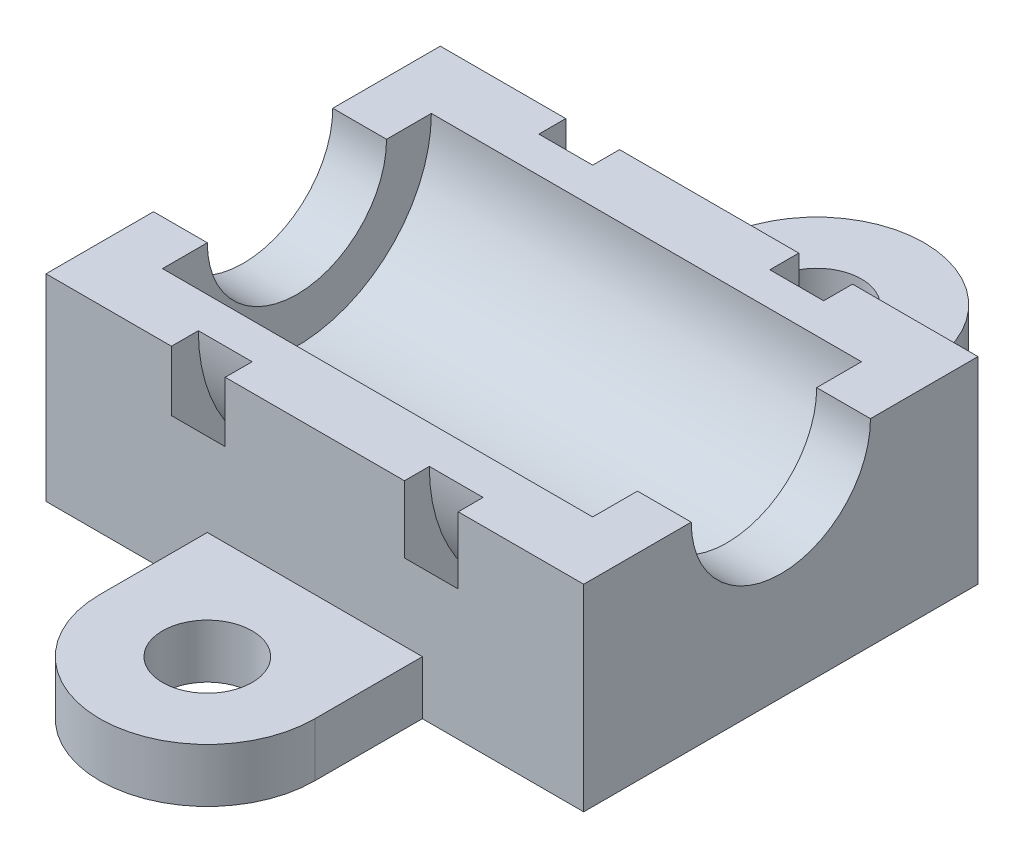
ISO-10303-21;
HEADER;
FILE_DESCRIPTION(('STEP AP214'),'2;1');
FILE_NAME('part.step','',(''),(''),'','','');
FILE_SCHEMA(('AUTOMOTIVE_DESIGN { 1 0 10303 214 1 1 1 1 }'));
ENDSEC;
DATA;
#1=APPLICATION_CONTEXT('core data for automotive mechanical design processes');
#2=APPLICATION_PROTOCOL_DEFINITION('international standard','automotive_design',2000,#1);
#3=PRODUCT_CONTEXT('',#1,'mechanical');
#4=PRODUCT('Part','Part','',(#3));
#5=PRODUCT_RELATED_PRODUCT_CATEGORY('part','',(#4));
#6=PRODUCT_DEFINITION_FORMATION('','',#4);
#7=PRODUCT_DEFINITION_CONTEXT('part definition',#1,'design');
#8=PRODUCT_DEFINITION('design','',#6,#7);
#9=PRODUCT_DEFINITION_SHAPE('','',#8);
#10=(LENGTH_UNIT() NAMED_UNIT(*) SI_UNIT(.MILLI.,.METRE.));
#11=(NAMED_UNIT(*) PLANE_ANGLE_UNIT() SI_UNIT($,.RADIAN.));
#12=(NAMED_UNIT(*) SI_UNIT($,.STERADIAN.) SOLID_ANGLE_UNIT());
#13=UNCERTAINTY_MEASURE_WITH_UNIT(LENGTH_MEASURE(1.E-05),#10,'distance_accuracy_value','');
#14=(GEOMETRIC_REPRESENTATION_CONTEXT(3) GLOBAL_UNCERTAINTY_ASSIGNED_CONTEXT((#13)) GLOBAL_UNIT_ASSIGNED_CONTEXT((#10,
#11,#12)) REPRESENTATION_CONTEXT('',''));
#15=CARTESIAN_POINT('',(0.,0.,0.));
#16=DIRECTION('',(0.,0.,1.));
#17=DIRECTION('',(1.,0.,0.));
#18=AXIS2_PLACEMENT_3D('',#15,#16,#17);
#19=CARTESIAN_POINT('',(30.,11.,-11.));
#20=DIRECTION('',(-1.,0.,0.));
#21=DIRECTION('',(0.,0.,1.));
#22=AXIS2_PLACEMENT_3D('',#19,#20,#21);
#23=CYLINDRICAL_SURFACE('',#22,5.);
#24=CARTESIAN_POINT('',(27.,11.,-11.));
#25=DIRECTION('',(-1.,0.,0.));
#26=DIRECTION('',(0.,0.,1.));
#27=AXIS2_PLACEMENT_3D('',#24,#25,#26);
#28=CIRCLE('',#27,5.);
#29=CARTESIAN_POINT('',(27.,11.,-6.));
#30=VERTEX_POINT('',#29);
#31=CARTESIAN_POINT('',(27.,11.,-16.));
#32=VERTEX_POINT('',#31);
#33=EDGE_CURVE('E508',#30,#32,#28,.F.);
#34=ORIENTED_EDGE('',*,*,#33,.F.);
#35=DIRECTION('',(-1.,0.,0.));
#36=VECTOR('',#35,1.);
#37=CARTESIAN_POINT('',(30.,11.,-6.));
#38=LINE('',#37,#36);
#39=CARTESIAN_POINT('',(30.,11.,-6.));
#40=VERTEX_POINT('',#39);
#41=EDGE_CURVE('E271',#30,#40,#38,.F.);
#42=ORIENTED_EDGE('',*,*,#41,.T.);
#43=CARTESIAN_POINT('',(30.,11.,-11.));
#44=DIRECTION('',(-1.,0.,0.));
#45=DIRECTION('',(0.,0.,1.));
#46=AXIS2_PLACEMENT_3D('',#43,#44,#45);
#47=CIRCLE('',#46,5.);
#48=CARTESIAN_POINT('',(30.,11.,-16.));
#49=VERTEX_POINT('',#48);
#50=EDGE_CURVE('E362',#49,#40,#47,.T.);
#51=ORIENTED_EDGE('',*,*,#50,.F.);
#52=DIRECTION('',(-1.,0.,0.));
#53=VECTOR('',#52,1.);
#54=CARTESIAN_POINT('',(30.,11.,-16.));
#55=LINE('',#54,#53);
#56=EDGE_CURVE('E484',#49,#32,#55,.T.);
#57=ORIENTED_EDGE('',*,*,#56,.T.);
#58=EDGE_LOOP('',(#34,#42,#51,#57));
#59=FACE_BOUND('',#58,.T.);
#60=ADVANCED_FACE('F35',(#59),#23,.F.);
#61=CARTESIAN_POINT('',(0.,0.,0.));
#62=DIRECTION('',(0.,1.,0.));
#63=DIRECTION('',(0.,0.,1.));
#64=AXIS2_PLACEMENT_3D('',#61,#62,#63);
#65=PLANE('',#64);
#66=DIRECTION('',(1.,0.,0.));
#67=VECTOR('',#66,1.);
#68=CARTESIAN_POINT('',(7.,0.,-7.64589803375031));
#69=LINE('',#68,#67);
#70=CARTESIAN_POINT('',(10.,0.,-7.64589803375031));
#71=VERTEX_POINT('',#70);
#72=CARTESIAN_POINT('',(7.,0.,-7.64589803375031));
#73=VERTEX_POINT('',#72);
#74=EDGE_CURVE('E494',#71,#73,#69,.F.);
#75=ORIENTED_EDGE('',*,*,#74,.F.);
#76=DIRECTION('',(0.,0.,1.));
#77=VECTOR('',#76,1.);
#78=CARTESIAN_POINT('',(10.,0.,0.));
#79=LINE('',#78,#77);
#80=CARTESIAN_POINT('',(10.,0.,-14.3541019662497));
#81=VERTEX_POINT('',#80);
#82=EDGE_CURVE('E489',#81,#71,#79,.T.);
#83=ORIENTED_EDGE('',*,*,#82,.F.);
#84=DIRECTION('',(1.,0.,0.));
#85=VECTOR('',#84,1.);
#86=CARTESIAN_POINT('',(7.,0.,-14.3541019662497));
#87=LINE('',#86,#85);
#88=CARTESIAN_POINT('',(7.,0.,-14.3541019662497));
#89=VERTEX_POINT('',#88);
#90=EDGE_CURVE('E487',#89,#81,#87,.T.);
#91=ORIENTED_EDGE('',*,*,#90,.F.);
#92=DIRECTION('',(0.,0.,1.));
#93=VECTOR('',#92,1.);
#94=CARTESIAN_POINT('',(7.,0.,0.));
#95=LINE('',#94,#93);
#96=EDGE_CURVE('E491',#89,#73,#95,.T.);
#97=ORIENTED_EDGE('',*,*,#96,.T.);
#98=EDGE_LOOP('',(#75,#83,#91,#97));
#99=FACE_BOUND('',#98,.T.);
#100=DIRECTION('',(0.,0.,1.));
#101=VECTOR('',#100,1.);
#102=CARTESIAN_POINT('',(0.,0.,-22.));
#103=LINE('',#102,#101);
#104=CARTESIAN_POINT('',(0.,0.,-22.));
#105=VERTEX_POINT('',#104);
#106=CARTESIAN_POINT('',(0.,0.,0.));
#107=VERTEX_POINT('',#106);
#108=EDGE_CURVE('E432',#105,#107,#103,.T.);
#109=ORIENTED_EDGE('',*,*,#108,.F.);
#110=DIRECTION('',(-1.,0.,0.));
#111=VECTOR('',#110,1.);
#112=CARTESIAN_POINT('',(30.,0.,-22.));
#113=LINE('',#112,#111);
#114=CARTESIAN_POINT('',(9.,0.,-22.));
#115=VERTEX_POINT('',#114);
#116=EDGE_CURVE('E465',#115,#105,#113,.T.);
#117=ORIENTED_EDGE('',*,*,#116,.F.);
#118=DIRECTION('',(0.,0.,-1.));
#119=VECTOR('',#118,1.);
#120=CARTESIAN_POINT('',(9.,0.,-22.));
#121=LINE('',#120,#119);
#122=CARTESIAN_POINT('',(9.,0.,-28.));
#123=VERTEX_POINT('',#122);
#124=EDGE_CURVE('E377',#115,#123,#121,.T.);
#125=ORIENTED_EDGE('',*,*,#124,.T.);
#126=CARTESIAN_POINT('',(15.,0.,-28.));
#127=DIRECTION('',(0.,-1.,0.));
#128=DIRECTION('',(0.,0.,1.));
#129=AXIS2_PLACEMENT_3D('',#126,#127,#128);
#130=CIRCLE('',#129,6.);
#131=CARTESIAN_POINT('',(21.,0.,-28.));
#132=VERTEX_POINT('',#131);
#133=EDGE_CURVE('E370',#123,#132,#130,.T.);
#134=ORIENTED_EDGE('',*,*,#133,.T.);
#135=DIRECTION('',(0.,0.,1.));
#136=VECTOR('',#135,1.);
#137=CARTESIAN_POINT('',(21.,0.,-28.));
#138=LINE('',#137,#136);
#139=CARTESIAN_POINT('',(21.,0.,-22.));
#140=VERTEX_POINT('',#139);
#141=EDGE_CURVE('E389',#132,#140,#138,.T.);
#142=ORIENTED_EDGE('',*,*,#141,.T.);
#143=CARTESIAN_POINT('',(30.,0.,-22.));
#144=VERTEX_POINT('',#143);
#145=EDGE_CURVE('E466',#144,#140,#113,.T.);
#146=ORIENTED_EDGE('',*,*,#145,.F.);
#147=DIRECTION('',(0.,0.,-1.));
#148=VECTOR('',#147,1.);
#149=CARTESIAN_POINT('',(30.,0.,0.));
#150=LINE('',#149,#148);
#151=CARTESIAN_POINT('',(30.,0.,0.));
#152=VERTEX_POINT('',#151);
#153=EDGE_CURVE('E463',#152,#144,#150,.T.);
#154=ORIENTED_EDGE('',*,*,#153,.F.);
#155=DIRECTION('',(1.,0.,0.));
#156=VECTOR('',#155,1.);
#157=CARTESIAN_POINT('',(0.,0.,0.));
#158=LINE('',#157,#156);
#159=CARTESIAN_POINT('',(21.,0.,0.));
#160=VERTEX_POINT('',#159);
#161=EDGE_CURVE('E459',#160,#152,#158,.T.);
#162=ORIENTED_EDGE('',*,*,#161,.F.);
#163=DIRECTION('',(0.,0.,1.));
#164=VECTOR('',#163,1.);
#165=CARTESIAN_POINT('',(21.,0.,6.));
#166=LINE('',#165,#164);
#167=CARTESIAN_POINT('',(21.,0.,6.));
#168=VERTEX_POINT('',#167);
#169=EDGE_CURVE('E413',#160,#168,#166,.T.);
#170=ORIENTED_EDGE('',*,*,#169,.T.);
#171=CARTESIAN_POINT('',(15.,0.,6.));
#172=DIRECTION('',(0.,-1.,0.));
#173=DIRECTION('',(0.,0.,-1.));
#174=AXIS2_PLACEMENT_3D('',#171,#172,#173);
#175=CIRCLE('',#174,6.);
#176=CARTESIAN_POINT('',(9.,0.,6.));
#177=VERTEX_POINT('',#176);
#178=EDGE_CURVE('E406',#168,#177,#175,.T.);
#179=ORIENTED_EDGE('',*,*,#178,.T.);
#180=DIRECTION('',(0.,0.,-1.));
#181=VECTOR('',#180,1.);
#182=CARTESIAN_POINT('',(9.,0.,0.));
#183=LINE('',#182,#181);
#184=CARTESIAN_POINT('',(9.,0.,0.));
#185=VERTEX_POINT('',#184);
#186=EDGE_CURVE('E425',#177,#185,#183,.T.);
#187=ORIENTED_EDGE('',*,*,#186,.T.);
#188=EDGE_CURVE('E460',#107,#185,#158,.T.);
#189=ORIENTED_EDGE('',*,*,#188,.F.);
#190=EDGE_LOOP('',(#109,#117,#125,#134,#142,#146,#154,#162,#170,#179,#187,#189));
#191=FACE_BOUND('',#190,.T.);
#192=CARTESIAN_POINT('',(15.,0.,6.));
#193=DIRECTION('',(0.,-1.,0.));
#194=DIRECTION('',(0.,0.,-1.));
#195=AXIS2_PLACEMENT_3D('',#192,#193,#194);
#196=CIRCLE('',#195,2.5);
#197=CARTESIAN_POINT('',(15.,0.,3.5));
#198=VERTEX_POINT('',#197);
#199=EDGE_CURVE('E396',#198,#198,#196,.T.);
#200=ORIENTED_EDGE('',*,*,#199,.F.);
#201=EDGE_LOOP('',(#200));
#202=FACE_BOUND('',#201,.T.);
#203=CARTESIAN_POINT('',(15.,0.,-28.));
#204=DIRECTION('',(0.,-1.,0.));
#205=DIRECTION('',(0.,0.,1.));
#206=AXIS2_PLACEMENT_3D('',#203,#204,#205);
#207=CIRCLE('',#206,2.5);
#208=CARTESIAN_POINT('',(15.,0.,-25.5));
#209=VERTEX_POINT('',#208);
#210=EDGE_CURVE('E365',#209,#209,#207,.T.);
#211=ORIENTED_EDGE('',*,*,#210,.F.);
#212=EDGE_LOOP('',(#211));
#213=FACE_BOUND('',#212,.T.);
#214=DIRECTION('',(-1.,0.,0.));
#215=VECTOR('',#214,1.);
#216=CARTESIAN_POINT('',(23.,0.,-14.3294980378266));
#217=LINE('',#216,#215);
#218=CARTESIAN_POINT('',(20.,0.,-14.3294980378266));
#219=VERTEX_POINT('',#218);
#220=CARTESIAN_POINT('',(23.,0.,-14.3294980378266));
#221=VERTEX_POINT('',#220);
#222=EDGE_CURVE('E320',#219,#221,#217,.F.);
#223=ORIENTED_EDGE('',*,*,#222,.F.);
#224=DIRECTION('',(0.,0.,-1.));
#225=VECTOR('',#224,1.);
#226=CARTESIAN_POINT('',(20.,0.,0.));
#227=LINE('',#226,#225);
#228=CARTESIAN_POINT('',(20.,0.,-7.44487365788936));
#229=VERTEX_POINT('',#228);
#230=EDGE_CURVE('E303',#229,#219,#227,.T.);
#231=ORIENTED_EDGE('',*,*,#230,.F.);
#232=DIRECTION('',(-1.,0.,0.));
#233=VECTOR('',#232,1.);
#234=CARTESIAN_POINT('',(23.,0.,-7.44487365788936));
#235=LINE('',#234,#233);
#236=CARTESIAN_POINT('',(23.,0.,-7.44487365788936));
#237=VERTEX_POINT('',#236);
#238=EDGE_CURVE('E318',#237,#229,#235,.T.);
#239=ORIENTED_EDGE('',*,*,#238,.F.);
#240=DIRECTION('',(0.,0.,-1.));
#241=VECTOR('',#240,1.);
#242=CARTESIAN_POINT('',(23.,0.,0.));
#243=LINE('',#242,#241);
#244=EDGE_CURVE('E313',#237,#221,#243,.T.);
#245=ORIENTED_EDGE('',*,*,#244,.T.);
#246=EDGE_LOOP('',(#223,#231,#239,#245));
#247=FACE_BOUND('',#246,.T.);
#248=ADVANCED_FACE('F539',(#99,#191,#202,#213,#247),#65,.F.);
#249=CARTESIAN_POINT('',(0.,11.,0.));
#250=DIRECTION('',(0.,1.,0.));
#251=DIRECTION('',(0.,0.,1.));
#252=AXIS2_PLACEMENT_3D('',#249,#250,#251);
#253=PLANE('',#252);
#254=DIRECTION('',(0.,0.,1.));
#255=VECTOR('',#254,1.);
#256=CARTESIAN_POINT('',(3.,11.,0.));
#257=LINE('',#256,#255);
#258=CARTESIAN_POINT('',(3.,11.,-18.5));
#259=VERTEX_POINT('',#258);
#260=CARTESIAN_POINT('',(3.,11.,-16.));
#261=VERTEX_POINT('',#260);
#262=EDGE_CURVE('E278',#259,#261,#257,.T.);
#263=ORIENTED_EDGE('',*,*,#262,.F.);
#264=DIRECTION('',(-1.,0.,0.));
#265=VECTOR('',#264,1.);
#266=CARTESIAN_POINT('',(51.2132034355964,11.,-18.5));
#267=LINE('',#266,#265);
#268=CARTESIAN_POINT('',(27.,11.,-18.5));
#269=VERTEX_POINT('',#268);
#270=EDGE_CURVE('E280',#269,#259,#267,.T.);
#271=ORIENTED_EDGE('',*,*,#270,.F.);
#272=DIRECTION('',(0.,0.,1.));
#273=VECTOR('',#272,1.);
#274=CARTESIAN_POINT('',(27.,11.,0.));
#275=LINE('',#274,#273);
#276=EDGE_CURVE('E266',#269,#32,#275,.T.);
#277=ORIENTED_EDGE('',*,*,#276,.T.);
#278=ORIENTED_EDGE('',*,*,#56,.F.);
#279=DIRECTION('',(0.,0.,-1.));
#280=VECTOR('',#279,1.);
#281=CARTESIAN_POINT('',(30.,11.,0.));
#282=LINE('',#281,#280);
#283=CARTESIAN_POINT('',(30.,11.,-22.));
#284=VERTEX_POINT('',#283);
#285=EDGE_CURVE('E447',#49,#284,#282,.T.);
#286=ORIENTED_EDGE('',*,*,#285,.T.);
#287=DIRECTION('',(-1.,0.,0.));
#288=VECTOR('',#287,1.);
#289=CARTESIAN_POINT('',(30.,11.,-22.));
#290=LINE('',#289,#288);
#291=CARTESIAN_POINT('',(23.,11.,-22.));
#292=VERTEX_POINT('',#291);
#293=EDGE_CURVE('E452',#284,#292,#290,.T.);
#294=ORIENTED_EDGE('',*,*,#293,.T.);
#295=DIRECTION('',(0.,0.,-1.));
#296=VECTOR('',#295,1.);
#297=CARTESIAN_POINT('',(23.,11.,0.));
#298=LINE('',#297,#296);
#299=CARTESIAN_POINT('',(23.,11.,-20.3871466666929));
#300=VERTEX_POINT('',#299);
#301=EDGE_CURVE('E311',#300,#292,#298,.T.);
#302=ORIENTED_EDGE('',*,*,#301,.F.);
#303=DIRECTION('',(-1.,0.,0.));
#304=VECTOR('',#303,1.);
#305=CARTESIAN_POINT('',(23.,11.,-20.3871466666929));
#306=LINE('',#305,#304);
#307=CARTESIAN_POINT('',(20.,11.,-20.3871466666929));
#308=VERTEX_POINT('',#307);
#309=EDGE_CURVE('E290',#308,#300,#306,.F.);
#310=ORIENTED_EDGE('',*,*,#309,.F.);
#311=DIRECTION('',(0.,0.,-1.));
#312=VECTOR('',#311,1.);
#313=CARTESIAN_POINT('',(20.,11.,0.));
#314=LINE('',#313,#312);
#315=CARTESIAN_POINT('',(20.,11.,-22.));
#316=VERTEX_POINT('',#315);
#317=EDGE_CURVE('E300',#308,#316,#314,.T.);
#318=ORIENTED_EDGE('',*,*,#317,.T.);
#319=CARTESIAN_POINT('',(10.,11.,-22.));
#320=VERTEX_POINT('',#319);
#321=EDGE_CURVE('E456',#316,#320,#290,.T.);
#322=ORIENTED_EDGE('',*,*,#321,.T.);
#323=DIRECTION('',(0.,0.,1.));
#324=VECTOR('',#323,1.);
#325=CARTESIAN_POINT('',(10.,11.,0.));
#326=LINE('',#325,#324);
#327=CARTESIAN_POINT('',(10.,11.,-20.5));
#328=VERTEX_POINT('',#327);
#329=EDGE_CURVE('E346',#320,#328,#326,.T.);
#330=ORIENTED_EDGE('',*,*,#329,.T.);
#331=DIRECTION('',(1.,0.,0.));
#332=VECTOR('',#331,1.);
#333=CARTESIAN_POINT('',(7.,11.,-20.5));
#334=LINE('',#333,#332);
#335=CARTESIAN_POINT('',(7.,11.,-20.5));
#336=VERTEX_POINT('',#335);
#337=EDGE_CURVE('E359',#336,#328,#334,.T.);
#338=ORIENTED_EDGE('',*,*,#337,.F.);
#339=DIRECTION('',(0.,0.,1.));
#340=VECTOR('',#339,1.);
#341=CARTESIAN_POINT('',(7.,11.,0.));
#342=LINE('',#341,#340);
#343=CARTESIAN_POINT('',(7.,11.,-22.));
#344=VERTEX_POINT('',#343);
#345=EDGE_CURVE('E357',#344,#336,#342,.T.);
#346=ORIENTED_EDGE('',*,*,#345,.F.);
#347=CARTESIAN_POINT('',(0.,11.,-22.));
#348=VERTEX_POINT('',#347);
#349=EDGE_CURVE('E451',#344,#348,#290,.T.);
#350=ORIENTED_EDGE('',*,*,#349,.T.);
#351=DIRECTION('',(0.,0.,1.));
#352=VECTOR('',#351,1.);
#353=CARTESIAN_POINT('',(0.,11.,-22.));
#354=LINE('',#353,#352);
#355=CARTESIAN_POINT('',(0.,11.,-16.));
#356=VERTEX_POINT('',#355);
#357=EDGE_CURVE('E439',#348,#356,#354,.T.);
#358=ORIENTED_EDGE('',*,*,#357,.T.);
#359=EDGE_CURVE('E483',#261,#356,#55,.T.);
#360=ORIENTED_EDGE('',*,*,#359,.F.);
#361=EDGE_LOOP('',(#263,#271,#277,#278,#286,#294,#302,#310,#318,#322,#330,#338,#346,#350,#358,#360));
#362=FACE_BOUND('',#361,.T.);
#363=ADVANCED_FACE('F518',(#362),#253,.T.);
#364=CARTESIAN_POINT('',(30.,11.,-22.));
#365=DIRECTION('',(0.,0.,1.));
#366=DIRECTION('',(1.,0.,0.));
#367=AXIS2_PLACEMENT_3D('',#364,#365,#366);
#368=PLANE('',#367);
#369=DIRECTION('',(-1.,0.,0.));
#370=VECTOR('',#369,1.);
#371=CARTESIAN_POINT('',(23.,8.01376952924734,-22.));
#372=LINE('',#371,#370);
#373=CARTESIAN_POINT('',(23.,8.01376952924734,-22.));
#374=VERTEX_POINT('',#373);
#375=CARTESIAN_POINT('',(20.,8.01376952924734,-22.));
#376=VERTEX_POINT('',#375);
#377=EDGE_CURVE('E316',#374,#376,#372,.T.);
#378=ORIENTED_EDGE('',*,*,#377,.F.);
#379=DIRECTION('',(0.,1.,0.));
#380=VECTOR('',#379,1.);
#381=CARTESIAN_POINT('',(23.,11.,-22.));
#382=LINE('',#381,#380);
#383=EDGE_CURVE('E308',#374,#292,#382,.T.);
#384=ORIENTED_EDGE('',*,*,#383,.T.);
#385=ORIENTED_EDGE('',*,*,#293,.F.);
#386=DIRECTION('',(0.,-1.,0.));
#387=VECTOR('',#386,1.);
#388=CARTESIAN_POINT('',(30.,11.,-22.));
#389=LINE('',#388,#387);
#390=EDGE_CURVE('E471',#284,#144,#389,.T.);
#391=ORIENTED_EDGE('',*,*,#390,.T.);
#392=ORIENTED_EDGE('',*,*,#145,.T.);
#393=DIRECTION('',(0.,-1.,0.));
#394=VECTOR('',#393,1.);
#395=CARTESIAN_POINT('',(21.,3.,-22.));
#396=LINE('',#395,#394);
#397=CARTESIAN_POINT('',(21.,3.,-22.));
#398=VERTEX_POINT('',#397);
#399=EDGE_CURVE('E400',#398,#140,#396,.T.);
#400=ORIENTED_EDGE('',*,*,#399,.F.);
#401=DIRECTION('',(-1.,0.,0.));
#402=VECTOR('',#401,1.);
#403=CARTESIAN_POINT('',(21.,3.,-22.));
#404=LINE('',#403,#402);
#405=CARTESIAN_POINT('',(9.,3.,-22.));
#406=VERTEX_POINT('',#405);
#407=EDGE_CURVE('E380',#398,#406,#404,.T.);
#408=ORIENTED_EDGE('',*,*,#407,.T.);
#409=DIRECTION('',(0.,-1.,0.));
#410=VECTOR('',#409,1.);
#411=CARTESIAN_POINT('',(9.,3.,-22.));
#412=LINE('',#411,#410);
#413=EDGE_CURVE('E397',#406,#115,#412,.T.);
#414=ORIENTED_EDGE('',*,*,#413,.T.);
#415=ORIENTED_EDGE('',*,*,#116,.T.);
#416=DIRECTION('',(0.,-1.,0.));
#417=VECTOR('',#416,1.);
#418=CARTESIAN_POINT('',(0.,11.,-22.));
#419=LINE('',#418,#417);
#420=EDGE_CURVE('E455',#348,#105,#419,.T.);
#421=ORIENTED_EDGE('',*,*,#420,.F.);
#422=ORIENTED_EDGE('',*,*,#349,.F.);
#423=DIRECTION('',(0.,-1.,0.));
#424=VECTOR('',#423,1.);
#425=CARTESIAN_POINT('',(7.,11.,-22.));
#426=LINE('',#425,#424);
#427=CARTESIAN_POINT('',(7.,7.64589803375031,-22.));
#428=VERTEX_POINT('',#427);
#429=EDGE_CURVE('E354',#344,#428,#426,.T.);
#430=ORIENTED_EDGE('',*,*,#429,.T.);
#431=DIRECTION('',(1.,0.,0.));
#432=VECTOR('',#431,1.);
#433=CARTESIAN_POINT('',(7.,7.64589803375031,-22.));
#434=LINE('',#433,#432);
#435=CARTESIAN_POINT('',(10.,7.64589803375031,-22.));
#436=VERTEX_POINT('',#435);
#437=EDGE_CURVE('E336',#436,#428,#434,.F.);
#438=ORIENTED_EDGE('',*,*,#437,.F.);
#439=DIRECTION('',(0.,-1.,0.));
#440=VECTOR('',#439,1.);
#441=CARTESIAN_POINT('',(10.,11.,-22.));
#442=LINE('',#441,#440);
#443=EDGE_CURVE('E343',#320,#436,#442,.T.);
#444=ORIENTED_EDGE('',*,*,#443,.F.);
#445=ORIENTED_EDGE('',*,*,#321,.F.);
#446=DIRECTION('',(0.,1.,0.));
#447=VECTOR('',#446,1.);
#448=CARTESIAN_POINT('',(20.,11.,-22.));
#449=LINE('',#448,#447);
#450=EDGE_CURVE('E298',#376,#316,#449,.T.);
#451=ORIENTED_EDGE('',*,*,#450,.F.);
#452=EDGE_LOOP('',(#378,#384,#385,#391,#392,#400,#408,#414,#415,#421,#422,#430,#438,#444,#445,#451));
#453=FACE_BOUND('',#452,.T.);
#454=ADVANCED_FACE('F604',(#453),#368,.F.);
#455=CARTESIAN_POINT('',(0.,11.,0.));
#456=DIRECTION('',(0.,0.,-1.));
#457=DIRECTION('',(-1.,0.,0.));
#458=AXIS2_PLACEMENT_3D('',#455,#456,#457);
#459=PLANE('',#458);
#460=DIRECTION('',(1.,0.,0.));
#461=VECTOR('',#460,1.);
#462=CARTESIAN_POINT('',(0.,11.,0.));
#463=LINE('',#462,#461);
#464=CARTESIAN_POINT('',(23.,11.,0.));
#465=VERTEX_POINT('',#464);
#466=CARTESIAN_POINT('',(30.,11.,0.));
#467=VERTEX_POINT('',#466);
#468=EDGE_CURVE('E442',#465,#467,#463,.T.);
#469=ORIENTED_EDGE('',*,*,#468,.F.);
#470=DIRECTION('',(0.,-1.,0.));
#471=VECTOR('',#470,1.);
#472=CARTESIAN_POINT('',(23.,11.,0.));
#473=LINE('',#472,#471);
#474=CARTESIAN_POINT('',(23.,7.26877383457005,0.));
#475=VERTEX_POINT('',#474);
#476=EDGE_CURVE('E305',#465,#475,#473,.T.);
#477=ORIENTED_EDGE('',*,*,#476,.T.);
#478=DIRECTION('',(-1.,0.,0.));
#479=VECTOR('',#478,1.);
#480=CARTESIAN_POINT('',(23.,7.26877383457005,0.));
#481=LINE('',#480,#479);
#482=CARTESIAN_POINT('',(20.,7.26877383457005,0.));
#483=VERTEX_POINT('',#482);
#484=EDGE_CURVE('E506',#483,#475,#481,.F.);
#485=ORIENTED_EDGE('',*,*,#484,.F.);
#486=DIRECTION('',(0.,-1.,0.));
#487=VECTOR('',#486,1.);
#488=CARTESIAN_POINT('',(20.,11.,0.));
#489=LINE('',#488,#487);
#490=CARTESIAN_POINT('',(20.,11.,0.));
#491=VERTEX_POINT('',#490);
#492=EDGE_CURVE('E296',#491,#483,#489,.T.);
#493=ORIENTED_EDGE('',*,*,#492,.F.);
#494=CARTESIAN_POINT('',(10.,11.,0.));
#495=VERTEX_POINT('',#494);
#496=EDGE_CURVE('E448',#495,#491,#463,.T.);
#497=ORIENTED_EDGE('',*,*,#496,.F.);
#498=DIRECTION('',(0.,1.,0.));
#499=VECTOR('',#498,1.);
#500=CARTESIAN_POINT('',(10.,11.,0.));
#501=LINE('',#500,#499);
#502=CARTESIAN_POINT('',(10.,7.64589803375031,0.));
#503=VERTEX_POINT('',#502);
#504=EDGE_CURVE('E341',#503,#495,#501,.T.);
#505=ORIENTED_EDGE('',*,*,#504,.F.);
#506=DIRECTION('',(1.,0.,0.));
#507=VECTOR('',#506,1.);
#508=CARTESIAN_POINT('',(7.,7.64589803375031,0.));
#509=LINE('',#508,#507);
#510=CARTESIAN_POINT('',(7.,7.64589803375031,0.));
#511=VERTEX_POINT('',#510);
#512=EDGE_CURVE('E330',#511,#503,#509,.T.);
#513=ORIENTED_EDGE('',*,*,#512,.F.);
#514=DIRECTION('',(0.,1.,0.));
#515=VECTOR('',#514,1.);
#516=CARTESIAN_POINT('',(7.,11.,0.));
#517=LINE('',#516,#515);
#518=CARTESIAN_POINT('',(7.,11.,0.));
#519=VERTEX_POINT('',#518);
#520=EDGE_CURVE('E351',#511,#519,#517,.T.);
#521=ORIENTED_EDGE('',*,*,#520,.T.);
#522=CARTESIAN_POINT('',(0.,11.,0.));
#523=VERTEX_POINT('',#522);
#524=EDGE_CURVE('E444',#523,#519,#463,.T.);
#525=ORIENTED_EDGE('',*,*,#524,.F.);
#526=DIRECTION('',(0.,-1.,0.));
#527=VECTOR('',#526,1.);
#528=CARTESIAN_POINT('',(0.,11.,0.));
#529=LINE('',#528,#527);
#530=EDGE_CURVE('E477',#523,#107,#529,.T.);
#531=ORIENTED_EDGE('',*,*,#530,.T.);
#532=ORIENTED_EDGE('',*,*,#188,.T.);
#533=DIRECTION('',(0.,-1.,0.));
#534=VECTOR('',#533,1.);
#535=CARTESIAN_POINT('',(9.,3.,0.));
#536=LINE('',#535,#534);
#537=CARTESIAN_POINT('',(9.,3.,0.));
#538=VERTEX_POINT('',#537);
#539=EDGE_CURVE('E436',#538,#185,#536,.T.);
#540=ORIENTED_EDGE('',*,*,#539,.F.);
#541=DIRECTION('',(1.,0.,0.));
#542=VECTOR('',#541,1.);
#543=CARTESIAN_POINT('',(21.,3.,0.));
#544=LINE('',#543,#542);
#545=CARTESIAN_POINT('',(21.,3.,0.));
#546=VERTEX_POINT('',#545);
#547=EDGE_CURVE('E416',#538,#546,#544,.T.);
#548=ORIENTED_EDGE('',*,*,#547,.T.);
#549=DIRECTION('',(0.,-1.,0.));
#550=VECTOR('',#549,1.);
#551=CARTESIAN_POINT('',(21.,3.,0.));
#552=LINE('',#551,#550);
#553=EDGE_CURVE('E433',#546,#160,#552,.T.);
#554=ORIENTED_EDGE('',*,*,#553,.T.);
#555=ORIENTED_EDGE('',*,*,#161,.T.);
#556=DIRECTION('',(0.,-1.,0.));
#557=VECTOR('',#556,1.);
#558=CARTESIAN_POINT('',(30.,11.,0.));
#559=LINE('',#558,#557);
#560=EDGE_CURVE('E474',#467,#152,#559,.T.);
#561=ORIENTED_EDGE('',*,*,#560,.F.);
#562=EDGE_LOOP('',(#469,#477,#485,#493,#497,#505,#513,#521,#525,#531,#532,#540,#548,#554,#555,#561));
#563=FACE_BOUND('',#562,.T.);
#564=ADVANCED_FACE('F607',(#563),#459,.F.);
#565=CARTESIAN_POINT('',(0.,11.,-22.));
#566=DIRECTION('',(1.,0.,0.));
#567=DIRECTION('',(0.,0.,-1.));
#568=AXIS2_PLACEMENT_3D('',#565,#566,#567);
#569=PLANE('',#568);
#570=CARTESIAN_POINT('',(0.,11.,-6.));
#571=VERTEX_POINT('',#570);
#572=EDGE_CURVE('E443',#571,#523,#354,.T.);
#573=ORIENTED_EDGE('',*,*,#572,.F.);
#574=CARTESIAN_POINT('',(0.,11.,-11.));
#575=DIRECTION('',(-1.,0.,0.));
#576=DIRECTION('',(0.,0.,1.));
#577=AXIS2_PLACEMENT_3D('',#574,#575,#576);
#578=CIRCLE('',#577,5.);
#579=EDGE_CURVE('E361',#356,#571,#578,.T.);
#580=ORIENTED_EDGE('',*,*,#579,.F.);
#581=ORIENTED_EDGE('',*,*,#357,.F.);
#582=ORIENTED_EDGE('',*,*,#420,.T.);
#583=ORIENTED_EDGE('',*,*,#108,.T.);
#584=ORIENTED_EDGE('',*,*,#530,.F.);
#585=EDGE_LOOP('',(#573,#580,#581,#582,#583,#584));
#586=FACE_BOUND('',#585,.T.);
#587=ADVANCED_FACE('F37',(#586),#569,.F.);
#588=CARTESIAN_POINT('',(30.,11.,0.));
#589=DIRECTION('',(-1.,0.,0.));
#590=DIRECTION('',(0.,0.,1.));
#591=AXIS2_PLACEMENT_3D('',#588,#589,#590);
#592=PLANE('',#591);
#593=ORIENTED_EDGE('',*,*,#285,.F.);
#594=ORIENTED_EDGE('',*,*,#50,.T.);
#595=EDGE_CURVE('E449',#467,#40,#282,.T.);
#596=ORIENTED_EDGE('',*,*,#595,.F.);
#597=ORIENTED_EDGE('',*,*,#560,.T.);
#598=ORIENTED_EDGE('',*,*,#153,.T.);
#599=ORIENTED_EDGE('',*,*,#390,.F.);
#600=EDGE_LOOP('',(#593,#594,#596,#597,#598,#599));
#601=FACE_BOUND('',#600,.T.);
#602=ADVANCED_FACE('F602',(#601),#592,.F.);
#603=DIRECTION('',(0.,0.,1.));
#604=VECTOR('',#603,1.);
#605=CARTESIAN_POINT('',(3.,11.,0.));
#606=LINE('',#605,#604);
#607=CARTESIAN_POINT('',(3.,11.,-6.));
#608=VERTEX_POINT('',#607);
#609=CARTESIAN_POINT('',(3.,11.,-3.5));
#610=VERTEX_POINT('',#609);
#611=EDGE_CURVE('E273',#608,#610,#606,.T.);
#612=ORIENTED_EDGE('',*,*,#611,.F.);
#613=EDGE_CURVE('E480',#571,#608,#38,.F.);
#614=ORIENTED_EDGE('',*,*,#613,.F.);
#615=ORIENTED_EDGE('',*,*,#572,.T.);
#616=ORIENTED_EDGE('',*,*,#524,.T.);
#617=DIRECTION('',(0.,0.,1.));
#618=VECTOR('',#617,1.);
#619=CARTESIAN_POINT('',(7.,11.,0.));
#620=LINE('',#619,#618);
#621=CARTESIAN_POINT('',(7.,11.,-1.5));
#622=VERTEX_POINT('',#621);
#623=EDGE_CURVE('E349',#622,#519,#620,.T.);
#624=ORIENTED_EDGE('',*,*,#623,.F.);
#625=DIRECTION('',(1.,0.,0.));
#626=VECTOR('',#625,1.);
#627=CARTESIAN_POINT('',(7.,11.,-1.5));
#628=LINE('',#627,#626);
#629=CARTESIAN_POINT('',(10.,11.,-1.5));
#630=VERTEX_POINT('',#629);
#631=EDGE_CURVE('E496',#630,#622,#628,.F.);
#632=ORIENTED_EDGE('',*,*,#631,.F.);
#633=DIRECTION('',(0.,0.,1.));
#634=VECTOR('',#633,1.);
#635=CARTESIAN_POINT('',(10.,11.,0.));
#636=LINE('',#635,#634);
#637=EDGE_CURVE('E338',#630,#495,#636,.T.);
#638=ORIENTED_EDGE('',*,*,#637,.T.);
#639=ORIENTED_EDGE('',*,*,#496,.T.);
#640=DIRECTION('',(0.,0.,-1.));
#641=VECTOR('',#640,1.);
#642=CARTESIAN_POINT('',(20.,11.,0.));
#643=LINE('',#642,#641);
#644=CARTESIAN_POINT('',(20.,11.,-1.38722502902307));
#645=VERTEX_POINT('',#644);
#646=EDGE_CURVE('E500',#491,#645,#643,.T.);
#647=ORIENTED_EDGE('',*,*,#646,.T.);
#648=DIRECTION('',(-1.,0.,0.));
#649=VECTOR('',#648,1.);
#650=CARTESIAN_POINT('',(23.,11.,-1.38722502902307));
#651=LINE('',#650,#649);
#652=CARTESIAN_POINT('',(23.,11.,-1.38722502902307));
#653=VERTEX_POINT('',#652);
#654=EDGE_CURVE('E498',#653,#645,#651,.T.);
#655=ORIENTED_EDGE('',*,*,#654,.F.);
#656=DIRECTION('',(0.,0.,-1.));
#657=VECTOR('',#656,1.);
#658=CARTESIAN_POINT('',(23.,11.,0.));
#659=LINE('',#658,#657);
#660=EDGE_CURVE('E503',#465,#653,#659,.T.);
#661=ORIENTED_EDGE('',*,*,#660,.F.);
#662=ORIENTED_EDGE('',*,*,#468,.T.);
#663=ORIENTED_EDGE('',*,*,#595,.T.);
#664=ORIENTED_EDGE('',*,*,#41,.F.);
#665=DIRECTION('',(0.,0.,1.));
#666=VECTOR('',#665,1.);
#667=CARTESIAN_POINT('',(27.,11.,0.));
#668=LINE('',#667,#666);
#669=CARTESIAN_POINT('',(27.,11.,-3.5));
#670=VERTEX_POINT('',#669);
#671=EDGE_CURVE('E50',#30,#670,#668,.T.);
#672=ORIENTED_EDGE('',*,*,#671,.T.);
#673=DIRECTION('',(-1.,0.,0.));
#674=VECTOR('',#673,1.);
#675=CARTESIAN_POINT('',(51.2132034355964,11.,-3.5));
#676=LINE('',#675,#674);
#677=EDGE_CURVE('E12',#610,#670,#676,.F.);
#678=ORIENTED_EDGE('',*,*,#677,.F.);
#679=EDGE_LOOP('',(#612,#614,#615,#616,#624,#632,#638,#639,#647,#655,#661,#662,#663,#664,#672,#678));
#680=FACE_BOUND('',#679,.T.);
#681=ADVANCED_FACE('F269',(#680),#253,.T.);
#682=CARTESIAN_POINT('',(15.,3.,6.));
#683=DIRECTION('',(0.,-1.,0.));
#684=DIRECTION('',(0.,0.,-1.));
#685=AXIS2_PLACEMENT_3D('',#682,#683,#684);
#686=CYLINDRICAL_SURFACE('',#685,6.);
#687=ORIENTED_EDGE('',*,*,#178,.F.);
#688=DIRECTION('',(0.,-1.,0.));
#689=VECTOR('',#688,1.);
#690=CARTESIAN_POINT('',(21.,3.,6.));
#691=LINE('',#690,#689);
#692=CARTESIAN_POINT('',(21.,3.,6.));
#693=VERTEX_POINT('',#692);
#694=EDGE_CURVE('E430',#693,#168,#691,.T.);
#695=ORIENTED_EDGE('',*,*,#694,.F.);
#696=CARTESIAN_POINT('',(15.,3.,6.));
#697=DIRECTION('',(0.,-1.,0.));
#698=DIRECTION('',(0.,0.,-1.));
#699=AXIS2_PLACEMENT_3D('',#696,#697,#698);
#700=CIRCLE('',#699,6.);
#701=CARTESIAN_POINT('',(9.,3.,6.));
#702=VERTEX_POINT('',#701);
#703=EDGE_CURVE('E409',#693,#702,#700,.T.);
#704=ORIENTED_EDGE('',*,*,#703,.T.);
#705=DIRECTION('',(0.,-1.,0.));
#706=VECTOR('',#705,1.);
#707=CARTESIAN_POINT('',(9.,3.,6.));
#708=LINE('',#707,#706);
#709=EDGE_CURVE('E422',#702,#177,#708,.T.);
#710=ORIENTED_EDGE('',*,*,#709,.T.);
#711=EDGE_LOOP('',(#687,#695,#704,#710));
#712=FACE_BOUND('',#711,.T.);
#713=ADVANCED_FACE('F593',(#712),#686,.T.);
#714=CARTESIAN_POINT('',(21.,3.,6.));
#715=DIRECTION('',(1.,0.,0.));
#716=DIRECTION('',(0.,0.,-1.));
#717=AXIS2_PLACEMENT_3D('',#714,#715,#716);
#718=PLANE('',#717);
#719=ORIENTED_EDGE('',*,*,#169,.F.);
#720=ORIENTED_EDGE('',*,*,#553,.F.);
#721=DIRECTION('',(0.,0.,1.));
#722=VECTOR('',#721,1.);
#723=CARTESIAN_POINT('',(21.,3.,6.));
#724=LINE('',#723,#722);
#725=EDGE_CURVE('E419',#546,#693,#724,.T.);
#726=ORIENTED_EDGE('',*,*,#725,.T.);
#727=ORIENTED_EDGE('',*,*,#694,.T.);
#728=EDGE_LOOP('',(#719,#720,#726,#727));
#729=FACE_BOUND('',#728,.T.);
#730=ADVANCED_FACE('F590',(#729),#718,.T.);
#731=CARTESIAN_POINT('',(9.,3.,0.));
#732=DIRECTION('',(-1.,0.,0.));
#733=DIRECTION('',(0.,0.,1.));
#734=AXIS2_PLACEMENT_3D('',#731,#732,#733);
#735=PLANE('',#734);
#736=ORIENTED_EDGE('',*,*,#186,.F.);
#737=ORIENTED_EDGE('',*,*,#709,.F.);
#738=DIRECTION('',(0.,0.,-1.));
#739=VECTOR('',#738,1.);
#740=CARTESIAN_POINT('',(9.,3.,0.));
#741=LINE('',#740,#739);
#742=EDGE_CURVE('E412',#702,#538,#741,.T.);
#743=ORIENTED_EDGE('',*,*,#742,.T.);
#744=ORIENTED_EDGE('',*,*,#539,.T.);
#745=EDGE_LOOP('',(#736,#737,#743,#744));
#746=FACE_BOUND('',#745,.T.);
#747=ADVANCED_FACE('F588',(#746),#735,.T.);
#748=CARTESIAN_POINT('',(15.,3.,6.));
#749=DIRECTION('',(0.,-1.,0.));
#750=DIRECTION('',(0.,0.,-1.));
#751=AXIS2_PLACEMENT_3D('',#748,#749,#750);
#752=PLANE('',#751);
#753=CARTESIAN_POINT('',(15.,3.,6.));
#754=DIRECTION('',(0.,-1.,0.));
#755=DIRECTION('',(0.,0.,-1.));
#756=AXIS2_PLACEMENT_3D('',#753,#754,#755);
#757=CIRCLE('',#756,2.5);
#758=CARTESIAN_POINT('',(15.,3.,3.5));
#759=VERTEX_POINT('',#758);
#760=EDGE_CURVE('E403',#759,#759,#757,.T.);
#761=ORIENTED_EDGE('',*,*,#760,.T.);
#762=EDGE_LOOP('',(#761));
#763=FACE_BOUND('',#762,.T.);
#764=ORIENTED_EDGE('',*,*,#703,.F.);
#765=ORIENTED_EDGE('',*,*,#725,.F.);
#766=ORIENTED_EDGE('',*,*,#547,.F.);
#767=ORIENTED_EDGE('',*,*,#742,.F.);
#768=EDGE_LOOP('',(#764,#765,#766,#767));
#769=FACE_BOUND('',#768,.T.);
#770=ADVANCED_FACE('F584',(#763,#769),#752,.F.);
#771=CARTESIAN_POINT('',(15.,3.,6.));
#772=DIRECTION('',(0.,-1.,0.));
#773=DIRECTION('',(0.,0.,-1.));
#774=AXIS2_PLACEMENT_3D('',#771,#772,#773);
#775=CYLINDRICAL_SURFACE('',#774,2.5);
#776=ORIENTED_EDGE('',*,*,#760,.F.);
#777=EDGE_LOOP('',(#776));
#778=FACE_BOUND('',#777,.T.);
#779=ORIENTED_EDGE('',*,*,#199,.T.);
#780=EDGE_LOOP('',(#779));
#781=FACE_BOUND('',#780,.T.);
#782=ADVANCED_FACE('F580',(#778,#781),#775,.F.);
#783=CARTESIAN_POINT('',(15.,3.,-28.));
#784=DIRECTION('',(0.,-1.,0.));
#785=DIRECTION('',(0.,0.,-1.));
#786=AXIS2_PLACEMENT_3D('',#783,#784,#785);
#787=CYLINDRICAL_SURFACE('',#786,6.);
#788=ORIENTED_EDGE('',*,*,#133,.F.);
#789=DIRECTION('',(0.,-1.,0.));
#790=VECTOR('',#789,1.);
#791=CARTESIAN_POINT('',(9.,3.,-28.));
#792=LINE('',#791,#790);
#793=CARTESIAN_POINT('',(9.,3.,-28.));
#794=VERTEX_POINT('',#793);
#795=EDGE_CURVE('E394',#794,#123,#792,.T.);
#796=ORIENTED_EDGE('',*,*,#795,.F.);
#797=CARTESIAN_POINT('',(15.,3.,-28.));
#798=DIRECTION('',(0.,-1.,0.));
#799=DIRECTION('',(0.,0.,1.));
#800=AXIS2_PLACEMENT_3D('',#797,#798,#799);
#801=CIRCLE('',#800,6.);
#802=CARTESIAN_POINT('',(21.,3.,-28.));
#803=VERTEX_POINT('',#802);
#804=EDGE_CURVE('E373',#794,#803,#801,.T.);
#805=ORIENTED_EDGE('',*,*,#804,.T.);
#806=DIRECTION('',(0.,-1.,0.));
#807=VECTOR('',#806,1.);
#808=CARTESIAN_POINT('',(21.,3.,-28.));
#809=LINE('',#808,#807);
#810=EDGE_CURVE('E386',#803,#132,#809,.T.);
#811=ORIENTED_EDGE('',*,*,#810,.T.);
#812=EDGE_LOOP('',(#788,#796,#805,#811));
#813=FACE_BOUND('',#812,.T.);
#814=ADVANCED_FACE('F573',(#813),#787,.T.);
#815=CARTESIAN_POINT('',(9.,3.,-22.));
#816=DIRECTION('',(-1.,0.,0.));
#817=DIRECTION('',(0.,0.,1.));
#818=AXIS2_PLACEMENT_3D('',#815,#816,#817);
#819=PLANE('',#818);
#820=ORIENTED_EDGE('',*,*,#124,.F.);
#821=ORIENTED_EDGE('',*,*,#413,.F.);
#822=DIRECTION('',(0.,0.,-1.));
#823=VECTOR('',#822,1.);
#824=CARTESIAN_POINT('',(9.,3.,-22.));
#825=LINE('',#824,#823);
#826=EDGE_CURVE('E383',#406,#794,#825,.T.);
#827=ORIENTED_EDGE('',*,*,#826,.T.);
#828=ORIENTED_EDGE('',*,*,#795,.T.);
#829=EDGE_LOOP('',(#820,#821,#827,#828));
#830=FACE_BOUND('',#829,.T.);
#831=ADVANCED_FACE('F570',(#830),#819,.T.);
#832=CARTESIAN_POINT('',(21.,3.,-28.));
#833=DIRECTION('',(1.,0.,0.));
#834=DIRECTION('',(0.,0.,-1.));
#835=AXIS2_PLACEMENT_3D('',#832,#833,#834);
#836=PLANE('',#835);
#837=ORIENTED_EDGE('',*,*,#141,.F.);
#838=ORIENTED_EDGE('',*,*,#810,.F.);
#839=DIRECTION('',(0.,0.,1.));
#840=VECTOR('',#839,1.);
#841=CARTESIAN_POINT('',(21.,3.,-28.));
#842=LINE('',#841,#840);
#843=EDGE_CURVE('E376',#803,#398,#842,.T.);
#844=ORIENTED_EDGE('',*,*,#843,.T.);
#845=ORIENTED_EDGE('',*,*,#399,.T.);
#846=EDGE_LOOP('',(#837,#838,#844,#845));
#847=FACE_BOUND('',#846,.T.);
#848=ADVANCED_FACE('F564',(#847),#836,.T.);
#849=CARTESIAN_POINT('',(15.,3.,-28.));
#850=DIRECTION('',(0.,1.,0.));
#851=DIRECTION('',(0.,0.,1.));
#852=AXIS2_PLACEMENT_3D('',#849,#850,#851);
#853=PLANE('',#852);
#854=CARTESIAN_POINT('',(15.,3.,-28.));
#855=DIRECTION('',(0.,-1.,0.));
#856=DIRECTION('',(0.,0.,1.));
#857=AXIS2_PLACEMENT_3D('',#854,#855,#856);
#858=CIRCLE('',#857,2.5);
#859=CARTESIAN_POINT('',(15.,3.,-25.5));
#860=VERTEX_POINT('',#859);
#861=EDGE_CURVE('E367',#860,#860,#858,.T.);
#862=ORIENTED_EDGE('',*,*,#861,.T.);
#863=EDGE_LOOP('',(#862));
#864=FACE_BOUND('',#863,.T.);
#865=ORIENTED_EDGE('',*,*,#804,.F.);
#866=ORIENTED_EDGE('',*,*,#826,.F.);
#867=ORIENTED_EDGE('',*,*,#407,.F.);
#868=ORIENTED_EDGE('',*,*,#843,.F.);
#869=EDGE_LOOP('',(#865,#866,#867,#868));
#870=FACE_BOUND('',#869,.T.);
#871=ADVANCED_FACE('F559',(#864,#870),#853,.T.);
#872=CARTESIAN_POINT('',(15.,3.,-28.));
#873=DIRECTION('',(0.,-1.,0.));
#874=DIRECTION('',(0.,0.,-1.));
#875=AXIS2_PLACEMENT_3D('',#872,#873,#874);
#876=CYLINDRICAL_SURFACE('',#875,2.5);
#877=ORIENTED_EDGE('',*,*,#861,.F.);
#878=EDGE_LOOP('',(#877));
#879=FACE_BOUND('',#878,.T.);
#880=ORIENTED_EDGE('',*,*,#210,.T.);
#881=EDGE_LOOP('',(#880));
#882=FACE_BOUND('',#881,.T.);
#883=ADVANCED_FACE('F551',(#879,#882),#876,.F.);
#884=ORIENTED_EDGE('',*,*,#613,.T.);
#885=CARTESIAN_POINT('',(3.,11.,-11.));
#886=DIRECTION('',(-1.,0.,0.));
#887=DIRECTION('',(0.,0.,1.));
#888=AXIS2_PLACEMENT_3D('',#885,#886,#887);
#889=CIRCLE('',#888,5.);
#890=EDGE_CURVE('E43',#608,#261,#889,.F.);
#891=ORIENTED_EDGE('',*,*,#890,.T.);
#892=ORIENTED_EDGE('',*,*,#359,.T.);
#893=ORIENTED_EDGE('',*,*,#579,.T.);
#894=EDGE_LOOP('',(#884,#891,#892,#893));
#895=FACE_BOUND('',#894,.T.);
#896=ADVANCED_FACE('F512',(#895),#23,.F.);
#897=CARTESIAN_POINT('',(7.,11.,-11.));
#898=DIRECTION('',(-1.,0.,0.));
#899=DIRECTION('',(0.,0.,1.));
#900=AXIS2_PLACEMENT_3D('',#897,#898,#899);
#901=PLANE('',#900);
#902=ORIENTED_EDGE('',*,*,#345,.T.);
#903=CARTESIAN_POINT('',(7.,11.,-11.));
#904=DIRECTION('',(-1.,0.,0.));
#905=DIRECTION('',(0.,0.,1.));
#906=AXIS2_PLACEMENT_3D('',#903,#904,#905);
#907=CIRCLE('',#906,9.5);
#908=EDGE_CURVE('E323',#336,#622,#907,.T.);
#909=ORIENTED_EDGE('',*,*,#908,.T.);
#910=ORIENTED_EDGE('',*,*,#623,.T.);
#911=ORIENTED_EDGE('',*,*,#520,.F.);
#912=CARTESIAN_POINT('',(7.,11.,-11.));
#913=DIRECTION('',(-1.,0.,0.));
#914=DIRECTION('',(0.,0.,1.));
#915=AXIS2_PLACEMENT_3D('',#912,#913,#914);
#916=CIRCLE('',#915,11.5);
#917=EDGE_CURVE('E331',#73,#511,#916,.T.);
#918=ORIENTED_EDGE('',*,*,#917,.F.);
#919=ORIENTED_EDGE('',*,*,#96,.F.);
#920=EDGE_CURVE('E328',#428,#89,#916,.T.);
#921=ORIENTED_EDGE('',*,*,#920,.F.);
#922=ORIENTED_EDGE('',*,*,#429,.F.);
#923=EDGE_LOOP('',(#902,#909,#910,#911,#918,#919,#921,#922));
#924=FACE_BOUND('',#923,.T.);
#925=ADVANCED_FACE('F550',(#924),#901,.F.);
#926=CARTESIAN_POINT('',(10.,11.,-11.));
#927=DIRECTION('',(-1.,0.,0.));
#928=DIRECTION('',(0.,0.,1.));
#929=AXIS2_PLACEMENT_3D('',#926,#927,#928);
#930=PLANE('',#929);
#931=ORIENTED_EDGE('',*,*,#443,.T.);
#932=CARTESIAN_POINT('',(10.,11.,-11.));
#933=DIRECTION('',(-1.,0.,0.));
#934=DIRECTION('',(0.,0.,1.));
#935=AXIS2_PLACEMENT_3D('',#932,#933,#934);
#936=CIRCLE('',#935,11.5);
#937=EDGE_CURVE('E332',#436,#81,#936,.T.);
#938=ORIENTED_EDGE('',*,*,#937,.T.);
#939=ORIENTED_EDGE('',*,*,#82,.T.);
#940=EDGE_CURVE('E326',#71,#503,#936,.T.);
#941=ORIENTED_EDGE('',*,*,#940,.T.);
#942=ORIENTED_EDGE('',*,*,#504,.T.);
#943=ORIENTED_EDGE('',*,*,#637,.F.);
#944=CARTESIAN_POINT('',(10.,11.,-11.));
#945=DIRECTION('',(-1.,0.,0.));
#946=DIRECTION('',(0.,0.,1.));
#947=AXIS2_PLACEMENT_3D('',#944,#945,#946);
#948=CIRCLE('',#947,9.5);
#949=EDGE_CURVE('E322',#328,#630,#948,.T.);
#950=ORIENTED_EDGE('',*,*,#949,.F.);
#951=ORIENTED_EDGE('',*,*,#329,.F.);
#952=EDGE_LOOP('',(#931,#938,#939,#941,#942,#943,#950,#951));
#953=FACE_BOUND('',#952,.T.);
#954=ADVANCED_FACE('F556',(#953),#930,.T.);
#955=CARTESIAN_POINT('',(7.,11.,-11.));
#956=DIRECTION('',(1.,0.,0.));
#957=DIRECTION('',(0.,0.,-1.));
#958=AXIS2_PLACEMENT_3D('',#955,#956,#957);
#959=CYLINDRICAL_SURFACE('',#958,11.5);
#960=ORIENTED_EDGE('',*,*,#437,.T.);
#961=ORIENTED_EDGE('',*,*,#920,.T.);
#962=ORIENTED_EDGE('',*,*,#90,.T.);
#963=ORIENTED_EDGE('',*,*,#937,.F.);
#964=EDGE_LOOP('',(#960,#961,#962,#963));
#965=FACE_BOUND('',#964,.T.);
#966=ADVANCED_FACE('F672',(#965),#959,.F.);
#967=ORIENTED_EDGE('',*,*,#512,.T.);
#968=ORIENTED_EDGE('',*,*,#940,.F.);
#969=ORIENTED_EDGE('',*,*,#74,.T.);
#970=ORIENTED_EDGE('',*,*,#917,.T.);
#971=EDGE_LOOP('',(#967,#968,#969,#970));
#972=FACE_BOUND('',#971,.T.);
#973=ADVANCED_FACE('F668',(#972),#959,.F.);
#974=CARTESIAN_POINT('',(7.,11.,-11.));
#975=DIRECTION('',(1.,0.,0.));
#976=DIRECTION('',(0.,0.,-1.));
#977=AXIS2_PLACEMENT_3D('',#974,#975,#976);
#978=CYLINDRICAL_SURFACE('',#977,9.5);
#979=ORIENTED_EDGE('',*,*,#337,.T.);
#980=ORIENTED_EDGE('',*,*,#949,.T.);
#981=ORIENTED_EDGE('',*,*,#631,.T.);
#982=ORIENTED_EDGE('',*,*,#908,.F.);
#983=EDGE_LOOP('',(#979,#980,#981,#982));
#984=FACE_BOUND('',#983,.T.);
#985=ADVANCED_FACE('F666',(#984),#978,.T.);
#986=CARTESIAN_POINT('',(23.,10.9727155611906,-10.887185847858));
#987=DIRECTION('',(-1.,0.,0.));
#988=DIRECTION('',(0.,0.,1.));
#989=AXIS2_PLACEMENT_3D('',#986,#987,#988);
#990=CYLINDRICAL_SURFACE('',#989,11.5);
#991=ORIENTED_EDGE('',*,*,#222,.T.);
#992=CARTESIAN_POINT('',(23.,10.9727155611906,-10.887185847858));
#993=DIRECTION('',(1.,0.,0.));
#994=DIRECTION('',(0.,0.,-1.));
#995=AXIS2_PLACEMENT_3D('',#992,#993,#994);
#996=CIRCLE('',#995,11.5);
#997=EDGE_CURVE('E291',#221,#374,#996,.T.);
#998=ORIENTED_EDGE('',*,*,#997,.T.);
#999=ORIENTED_EDGE('',*,*,#377,.T.);
#1000=CARTESIAN_POINT('',(20.,10.9727155611906,-10.887185847858));
#1001=DIRECTION('',(1.,0.,0.));
#1002=DIRECTION('',(0.,0.,-1.));
#1003=AXIS2_PLACEMENT_3D('',#1000,#1001,#1002);
#1004=CIRCLE('',#1003,11.5);
#1005=EDGE_CURVE('E286',#219,#376,#1004,.T.);
#1006=ORIENTED_EDGE('',*,*,#1005,.F.);
#1007=EDGE_LOOP('',(#991,#998,#999,#1006));
#1008=FACE_BOUND('',#1007,.T.);
#1009=ADVANCED_FACE('F642',(#1008),#990,.F.);
#1010=ORIENTED_EDGE('',*,*,#238,.T.);
#1011=EDGE_CURVE('E292',#483,#229,#1004,.T.);
#1012=ORIENTED_EDGE('',*,*,#1011,.F.);
#1013=ORIENTED_EDGE('',*,*,#484,.T.);
#1014=EDGE_CURVE('E58',#475,#237,#996,.T.);
#1015=ORIENTED_EDGE('',*,*,#1014,.T.);
#1016=EDGE_LOOP('',(#1010,#1012,#1013,#1015));
#1017=FACE_BOUND('',#1016,.T.);
#1018=ADVANCED_FACE('F634',(#1017),#990,.F.);
#1019=CARTESIAN_POINT('',(23.,10.9727155611906,-10.887185847858));
#1020=DIRECTION('',(1.,0.,0.));
#1021=DIRECTION('',(0.,0.,-1.));
#1022=AXIS2_PLACEMENT_3D('',#1019,#1020,#1021);
#1023=PLANE('',#1022);
#1024=ORIENTED_EDGE('',*,*,#1014,.F.);
#1025=ORIENTED_EDGE('',*,*,#476,.F.);
#1026=ORIENTED_EDGE('',*,*,#660,.T.);
#1027=CARTESIAN_POINT('',(23.,10.9727155611906,-10.887185847858));
#1028=DIRECTION('',(1.,0.,0.));
#1029=DIRECTION('',(0.,0.,-1.));
#1030=AXIS2_PLACEMENT_3D('',#1027,#1028,#1029);
#1031=CIRCLE('',#1030,9.5);
#1032=EDGE_CURVE('E283',#653,#300,#1031,.T.);
#1033=ORIENTED_EDGE('',*,*,#1032,.T.);
#1034=ORIENTED_EDGE('',*,*,#301,.T.);
#1035=ORIENTED_EDGE('',*,*,#383,.F.);
#1036=ORIENTED_EDGE('',*,*,#997,.F.);
#1037=ORIENTED_EDGE('',*,*,#244,.F.);
#1038=EDGE_LOOP('',(#1024,#1025,#1026,#1033,#1034,#1035,#1036,#1037));
#1039=FACE_BOUND('',#1038,.T.);
#1040=ADVANCED_FACE('F654',(#1039),#1023,.F.);
#1041=CARTESIAN_POINT('',(20.,10.9727155611906,-10.887185847858));
#1042=DIRECTION('',(1.,0.,0.));
#1043=DIRECTION('',(0.,0.,-1.));
#1044=AXIS2_PLACEMENT_3D('',#1041,#1042,#1043);
#1045=PLANE('',#1044);
#1046=ORIENTED_EDGE('',*,*,#230,.T.);
#1047=ORIENTED_EDGE('',*,*,#1005,.T.);
#1048=ORIENTED_EDGE('',*,*,#450,.T.);
#1049=ORIENTED_EDGE('',*,*,#317,.F.);
#1050=CARTESIAN_POINT('',(20.,10.9727155611906,-10.887185847858));
#1051=DIRECTION('',(1.,0.,0.));
#1052=DIRECTION('',(0.,0.,-1.));
#1053=AXIS2_PLACEMENT_3D('',#1050,#1051,#1052);
#1054=CIRCLE('',#1053,9.5);
#1055=EDGE_CURVE('E282',#645,#308,#1054,.T.);
#1056=ORIENTED_EDGE('',*,*,#1055,.F.);
#1057=ORIENTED_EDGE('',*,*,#646,.F.);
#1058=ORIENTED_EDGE('',*,*,#492,.T.);
#1059=ORIENTED_EDGE('',*,*,#1011,.T.);
#1060=EDGE_LOOP('',(#1046,#1047,#1048,#1049,#1056,#1057,#1058,#1059));
#1061=FACE_BOUND('',#1060,.T.);
#1062=ADVANCED_FACE('F631',(#1061),#1045,.T.);
#1063=CARTESIAN_POINT('',(23.,10.9727155611906,-10.887185847858));
#1064=DIRECTION('',(-1.,0.,0.));
#1065=DIRECTION('',(0.,0.,1.));
#1066=AXIS2_PLACEMENT_3D('',#1063,#1064,#1065);
#1067=CYLINDRICAL_SURFACE('',#1066,9.5);
#1068=ORIENTED_EDGE('',*,*,#309,.T.);
#1069=ORIENTED_EDGE('',*,*,#1032,.F.);
#1070=ORIENTED_EDGE('',*,*,#654,.T.);
#1071=ORIENTED_EDGE('',*,*,#1055,.T.);
#1072=EDGE_LOOP('',(#1068,#1069,#1070,#1071));
#1073=FACE_BOUND('',#1072,.T.);
#1074=ADVANCED_FACE('F536',(#1073),#1067,.T.);
#1075=CARTESIAN_POINT('',(51.2132034355964,11.,-11.));
#1076=DIRECTION('',(-1.,0.,0.));
#1077=DIRECTION('',(0.,0.,1.));
#1078=AXIS2_PLACEMENT_3D('',#1075,#1076,#1077);
#1079=CYLINDRICAL_SURFACE('',#1078,7.5);
#1080=ORIENTED_EDGE('',*,*,#270,.T.);
#1081=CARTESIAN_POINT('',(3.,11.,-11.));
#1082=DIRECTION('',(-1.,0.,0.));
#1083=DIRECTION('',(0.,0.,1.));
#1084=AXIS2_PLACEMENT_3D('',#1081,#1082,#1083);
#1085=CIRCLE('',#1084,7.5);
#1086=EDGE_CURVE('E261',#259,#610,#1085,.T.);
#1087=ORIENTED_EDGE('',*,*,#1086,.T.);
#1088=ORIENTED_EDGE('',*,*,#677,.T.);
#1089=CARTESIAN_POINT('',(27.,11.,-11.));
#1090=DIRECTION('',(-1.,0.,0.));
#1091=DIRECTION('',(0.,0.,1.));
#1092=AXIS2_PLACEMENT_3D('',#1089,#1090,#1091);
#1093=CIRCLE('',#1092,7.5);
#1094=EDGE_CURVE('E258',#670,#269,#1093,.F.);
#1095=ORIENTED_EDGE('',*,*,#1094,.T.);
#1096=EDGE_LOOP('',(#1080,#1087,#1088,#1095));
#1097=FACE_BOUND('',#1096,.T.);
#1098=ADVANCED_FACE('F257',(#1097),#1079,.F.);
#1099=CARTESIAN_POINT('',(3.,11.,-11.));
#1100=DIRECTION('',(-1.,0.,0.));
#1101=DIRECTION('',(0.,0.,1.));
#1102=AXIS2_PLACEMENT_3D('',#1099,#1100,#1101);
#1103=PLANE('',#1102);
#1104=ORIENTED_EDGE('',*,*,#262,.T.);
#1105=ORIENTED_EDGE('',*,*,#890,.F.);
#1106=ORIENTED_EDGE('',*,*,#611,.T.);
#1107=ORIENTED_EDGE('',*,*,#1086,.F.);
#1108=EDGE_LOOP('',(#1104,#1105,#1106,#1107));
#1109=FACE_BOUND('',#1108,.T.);
#1110=ADVANCED_FACE('F528',(#1109),#1103,.F.);
#1111=CARTESIAN_POINT('',(27.,11.,0.));
#1112=DIRECTION('',(-1.,0.,0.));
#1113=DIRECTION('',(0.,0.,1.));
#1114=AXIS2_PLACEMENT_3D('',#1111,#1112,#1113);
#1115=PLANE('',#1114);
#1116=ORIENTED_EDGE('',*,*,#1094,.F.);
#1117=ORIENTED_EDGE('',*,*,#671,.F.);
#1118=ORIENTED_EDGE('',*,*,#33,.T.);
#1119=ORIENTED_EDGE('',*,*,#276,.F.);
#1120=EDGE_LOOP('',(#1116,#1117,#1118,#1119));
#1121=FACE_BOUND('',#1120,.T.);
#1122=ADVANCED_FACE('F264',(#1121),#1115,.T.);
#1123=CLOSED_SHELL('',(#60,#248,#363,#454,#564,#587,#602,#681,#713,#730,#747,#770,#782,#814,
#831,#848,#871,#883,#896,#925,#954,#966,#973,#985,#1009,#1018,#1040,#1062,#1074,#1098,#1110,#1122));
#1124=MANIFOLD_SOLID_BREP('B2',#1123);
#1125=ADVANCED_BREP_SHAPE_REPRESENTATION('',(#18,#1124),#14);
#1126=SHAPE_DEFINITION_REPRESENTATION(#9,#1125);
ENDSEC;
END-ISO-10303-21;
